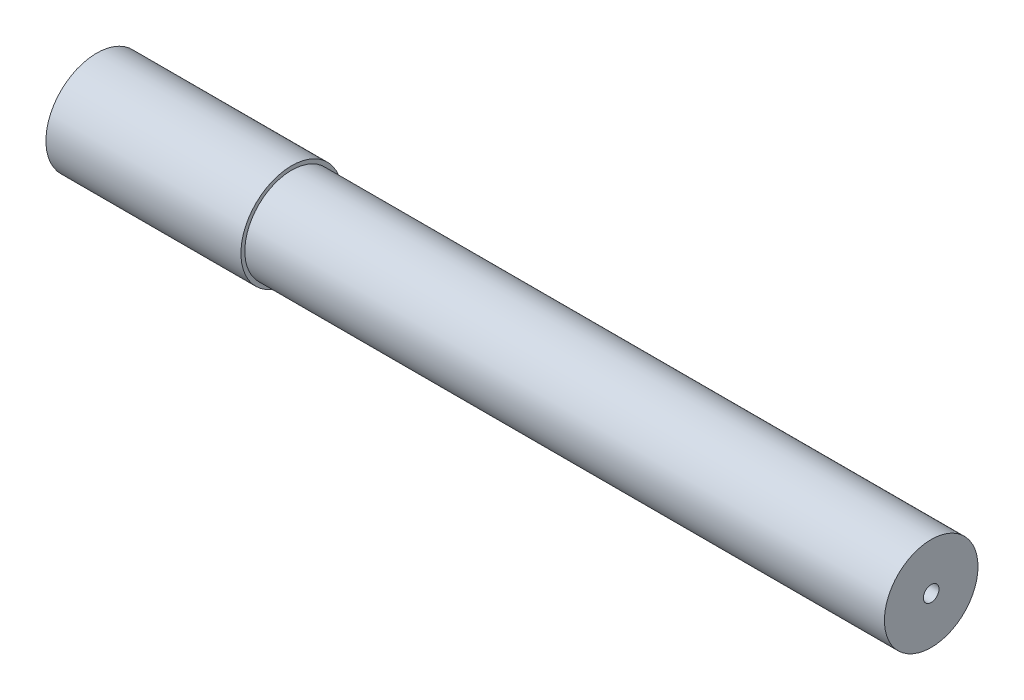
ISO-10303-21;
HEADER;
FILE_DESCRIPTION(('STEP AP214'),'2;1');
FILE_NAME('part.step','',(''),(''),'','','');
FILE_SCHEMA(('AUTOMOTIVE_DESIGN { 1 0 10303 214 1 1 1 1 }'));
ENDSEC;
DATA;
#1=APPLICATION_CONTEXT('core data for automotive mechanical design processes');
#2=APPLICATION_PROTOCOL_DEFINITION('international standard','automotive_design',2000,#1);
#3=PRODUCT_CONTEXT('',#1,'mechanical');
#4=PRODUCT('Part','Part','',(#3));
#5=PRODUCT_RELATED_PRODUCT_CATEGORY('part','',(#4));
#6=PRODUCT_DEFINITION_FORMATION('','',#4);
#7=PRODUCT_DEFINITION_CONTEXT('part definition',#1,'design');
#8=PRODUCT_DEFINITION('design','',#6,#7);
#9=PRODUCT_DEFINITION_SHAPE('','',#8);
#10=(LENGTH_UNIT() NAMED_UNIT(*) SI_UNIT(.MILLI.,.METRE.));
#11=(NAMED_UNIT(*) PLANE_ANGLE_UNIT() SI_UNIT($,.RADIAN.));
#12=(NAMED_UNIT(*) SI_UNIT($,.STERADIAN.) SOLID_ANGLE_UNIT());
#13=UNCERTAINTY_MEASURE_WITH_UNIT(LENGTH_MEASURE(1.E-05),#10,'distance_accuracy_value','');
#14=(GEOMETRIC_REPRESENTATION_CONTEXT(3) GLOBAL_UNCERTAINTY_ASSIGNED_CONTEXT((#13)) GLOBAL_UNIT_ASSIGNED_CONTEXT((#10,
#11,#12)) REPRESENTATION_CONTEXT('',''));
#15=CARTESIAN_POINT('',(0.,0.,0.));
#16=DIRECTION('',(0.,0.,1.));
#17=DIRECTION('',(1.,0.,0.));
#18=AXIS2_PLACEMENT_3D('',#15,#16,#17);
#19=CARTESIAN_POINT('',(-30.,3.25,0.));
#20=DIRECTION('',(1.,0.,0.));
#21=DIRECTION('',(0.,0.,-1.));
#22=AXIS2_PLACEMENT_3D('',#19,#20,#21);
#23=PLANE('',#22);
#24=CARTESIAN_POINT('',(-30.,0.,0.));
#25=DIRECTION('',(1.,0.,0.));
#26=DIRECTION('',(0.,0.,-1.));
#27=AXIS2_PLACEMENT_3D('',#24,#25,#26);
#28=CIRCLE('',#27,3.25);
#29=CARTESIAN_POINT('',(-30.,0.,-3.25));
#30=VERTEX_POINT('',#29);
#31=EDGE_CURVE('E10',#30,#30,#28,.T.);
#32=ORIENTED_EDGE('',*,*,#31,.T.);
#33=EDGE_LOOP('',(#32));
#34=FACE_BOUND('',#33,.T.);
#35=CARTESIAN_POINT('',(-30.,0.,0.));
#36=DIRECTION('',(1.,0.,0.));
#37=DIRECTION('',(0.,0.,-1.));
#38=AXIS2_PLACEMENT_3D('',#35,#36,#37);
#39=CIRCLE('',#38,2.99999999999999);
#40=CARTESIAN_POINT('',(-30.,0.,-2.99999999999999));
#41=VERTEX_POINT('',#40);
#42=EDGE_CURVE('E65',#41,#41,#39,.T.);
#43=ORIENTED_EDGE('',*,*,#42,.F.);
#44=EDGE_LOOP('',(#43));
#45=FACE_BOUND('',#44,.T.);
#46=ADVANCED_FACE('F37',(#34,#45),#23,.T.);
#47=CARTESIAN_POINT('',(13.5,0.,0.));
#48=DIRECTION('',(1.,0.,0.));
#49=DIRECTION('',(0.,0.,-1.));
#50=AXIS2_PLACEMENT_3D('',#47,#48,#49);
#51=CYLINDRICAL_SURFACE('',#50,3.25);
#52=CARTESIAN_POINT('',(-42.5,0.,0.));
#53=DIRECTION('',(1.,0.,0.));
#54=DIRECTION('',(0.,0.,-1.));
#55=AXIS2_PLACEMENT_3D('',#52,#53,#54);
#56=CIRCLE('',#55,3.25);
#57=CARTESIAN_POINT('',(-42.5,0.,-3.25));
#58=VERTEX_POINT('',#57);
#59=EDGE_CURVE('E43',#58,#58,#56,.T.);
#60=ORIENTED_EDGE('',*,*,#59,.T.);
#61=EDGE_LOOP('',(#60));
#62=FACE_BOUND('',#61,.T.);
#63=ORIENTED_EDGE('',*,*,#31,.F.);
#64=EDGE_LOOP('',(#63));
#65=FACE_BOUND('',#64,.T.);
#66=ADVANCED_FACE('F73',(#62,#65),#51,.T.);
#67=CARTESIAN_POINT('',(-42.5,3.25,0.));
#68=DIRECTION('',(-1.,0.,0.));
#69=DIRECTION('',(0.,0.,1.));
#70=AXIS2_PLACEMENT_3D('',#67,#68,#69);
#71=PLANE('',#70);
#72=CARTESIAN_POINT('',(-42.5,0.,0.));
#73=DIRECTION('',(1.,0.,0.));
#74=DIRECTION('',(0.,0.,-1.));
#75=AXIS2_PLACEMENT_3D('',#72,#73,#74);
#76=CIRCLE('',#75,2.24999999999999);
#77=CARTESIAN_POINT('',(-42.5,0.,-2.24999999999999));
#78=VERTEX_POINT('',#77);
#79=EDGE_CURVE('E47',#78,#78,#76,.T.);
#80=ORIENTED_EDGE('',*,*,#79,.T.);
#81=EDGE_LOOP('',(#80));
#82=FACE_BOUND('',#81,.T.);
#83=ORIENTED_EDGE('',*,*,#59,.F.);
#84=EDGE_LOOP('',(#83));
#85=FACE_BOUND('',#84,.T.);
#86=ADVANCED_FACE('F77',(#82,#85),#71,.T.);
#87=CARTESIAN_POINT('',(13.5,0.,0.));
#88=DIRECTION('',(1.,0.,0.));
#89=DIRECTION('',(0.,0.,-1.));
#90=AXIS2_PLACEMENT_3D('',#87,#88,#89);
#91=CYLINDRICAL_SURFACE('',#90,2.25);
#92=CARTESIAN_POINT('',(10.,0.,0.));
#93=DIRECTION('',(1.,0.,0.));
#94=DIRECTION('',(0.,0.,-1.));
#95=AXIS2_PLACEMENT_3D('',#92,#93,#94);
#96=CIRCLE('',#95,2.25);
#97=CARTESIAN_POINT('',(10.,0.,-2.25));
#98=VERTEX_POINT('',#97);
#99=EDGE_CURVE('E51',#98,#98,#96,.T.);
#100=ORIENTED_EDGE('',*,*,#99,.T.);
#101=EDGE_LOOP('',(#100));
#102=FACE_BOUND('',#101,.T.);
#103=ORIENTED_EDGE('',*,*,#79,.F.);
#104=EDGE_LOOP('',(#103));
#105=FACE_BOUND('',#104,.T.);
#106=ADVANCED_FACE('F81',(#102,#105),#91,.F.);
#107=CARTESIAN_POINT('',(10.,0.499999999999998,0.));
#108=DIRECTION('',(-1.,0.,0.));
#109=DIRECTION('',(0.,0.,1.));
#110=AXIS2_PLACEMENT_3D('',#107,#108,#109);
#111=PLANE('',#110);
#112=CARTESIAN_POINT('',(10.,0.,0.));
#113=DIRECTION('',(1.,0.,0.));
#114=DIRECTION('',(0.,0.,-1.));
#115=AXIS2_PLACEMENT_3D('',#112,#113,#114);
#116=CIRCLE('',#115,0.499999999999998);
#117=CARTESIAN_POINT('',(10.,0.,-0.499999999999998));
#118=VERTEX_POINT('',#117);
#119=EDGE_CURVE('E56',#118,#118,#116,.T.);
#120=ORIENTED_EDGE('',*,*,#119,.T.);
#121=EDGE_LOOP('',(#120));
#122=FACE_BOUND('',#121,.T.);
#123=ORIENTED_EDGE('',*,*,#99,.F.);
#124=EDGE_LOOP('',(#123));
#125=FACE_BOUND('',#124,.T.);
#126=ADVANCED_FACE('F88',(#122,#125),#111,.T.);
#127=CARTESIAN_POINT('',(13.5,0.,0.));
#128=DIRECTION('',(1.,0.,0.));
#129=DIRECTION('',(0.,0.,-1.));
#130=AXIS2_PLACEMENT_3D('',#127,#128,#129);
#131=CYLINDRICAL_SURFACE('',#130,0.499999999999998);
#132=CARTESIAN_POINT('',(11.,0.,0.));
#133=DIRECTION('',(1.,0.,0.));
#134=DIRECTION('',(0.,0.,-1.));
#135=AXIS2_PLACEMENT_3D('',#132,#133,#134);
#136=CIRCLE('',#135,0.499999999999998);
#137=CARTESIAN_POINT('',(11.,0.,-0.499999999999998));
#138=VERTEX_POINT('',#137);
#139=EDGE_CURVE('E59',#138,#138,#136,.T.);
#140=ORIENTED_EDGE('',*,*,#139,.T.);
#141=EDGE_LOOP('',(#140));
#142=FACE_BOUND('',#141,.T.);
#143=ORIENTED_EDGE('',*,*,#119,.F.);
#144=EDGE_LOOP('',(#143));
#145=FACE_BOUND('',#144,.T.);
#146=ADVANCED_FACE('F92',(#142,#145),#131,.F.);
#147=CARTESIAN_POINT('',(11.,2.99999999999999,0.));
#148=DIRECTION('',(1.,0.,0.));
#149=DIRECTION('',(0.,0.,-1.));
#150=AXIS2_PLACEMENT_3D('',#147,#148,#149);
#151=PLANE('',#150);
#152=CARTESIAN_POINT('',(11.,0.,0.));
#153=DIRECTION('',(1.,0.,0.));
#154=DIRECTION('',(0.,0.,-1.));
#155=AXIS2_PLACEMENT_3D('',#152,#153,#154);
#156=CIRCLE('',#155,2.99999999999999);
#157=CARTESIAN_POINT('',(11.,0.,-2.99999999999999));
#158=VERTEX_POINT('',#157);
#159=EDGE_CURVE('E62',#158,#158,#156,.T.);
#160=ORIENTED_EDGE('',*,*,#159,.T.);
#161=EDGE_LOOP('',(#160));
#162=FACE_BOUND('',#161,.T.);
#163=ORIENTED_EDGE('',*,*,#139,.F.);
#164=EDGE_LOOP('',(#163));
#165=FACE_BOUND('',#164,.T.);
#166=ADVANCED_FACE('F96',(#162,#165),#151,.T.);
#167=CARTESIAN_POINT('',(13.5,0.,0.));
#168=DIRECTION('',(1.,0.,0.));
#169=DIRECTION('',(0.,0.,-1.));
#170=AXIS2_PLACEMENT_3D('',#167,#168,#169);
#171=CYLINDRICAL_SURFACE('',#170,2.99999999999999);
#172=ORIENTED_EDGE('',*,*,#42,.T.);
#173=EDGE_LOOP('',(#172));
#174=FACE_BOUND('',#173,.T.);
#175=ORIENTED_EDGE('',*,*,#159,.F.);
#176=EDGE_LOOP('',(#175));
#177=FACE_BOUND('',#176,.T.);
#178=ADVANCED_FACE('F69',(#174,#177),#171,.T.);
#179=CLOSED_SHELL('',(#46,#66,#86,#106,#126,#146,#166,#178));
#180=MANIFOLD_SOLID_BREP('B2',#179);
#181=ADVANCED_BREP_SHAPE_REPRESENTATION('',(#18,#180),#14);
#182=SHAPE_DEFINITION_REPRESENTATION(#9,#181);
ENDSEC;
END-ISO-10303-21;
